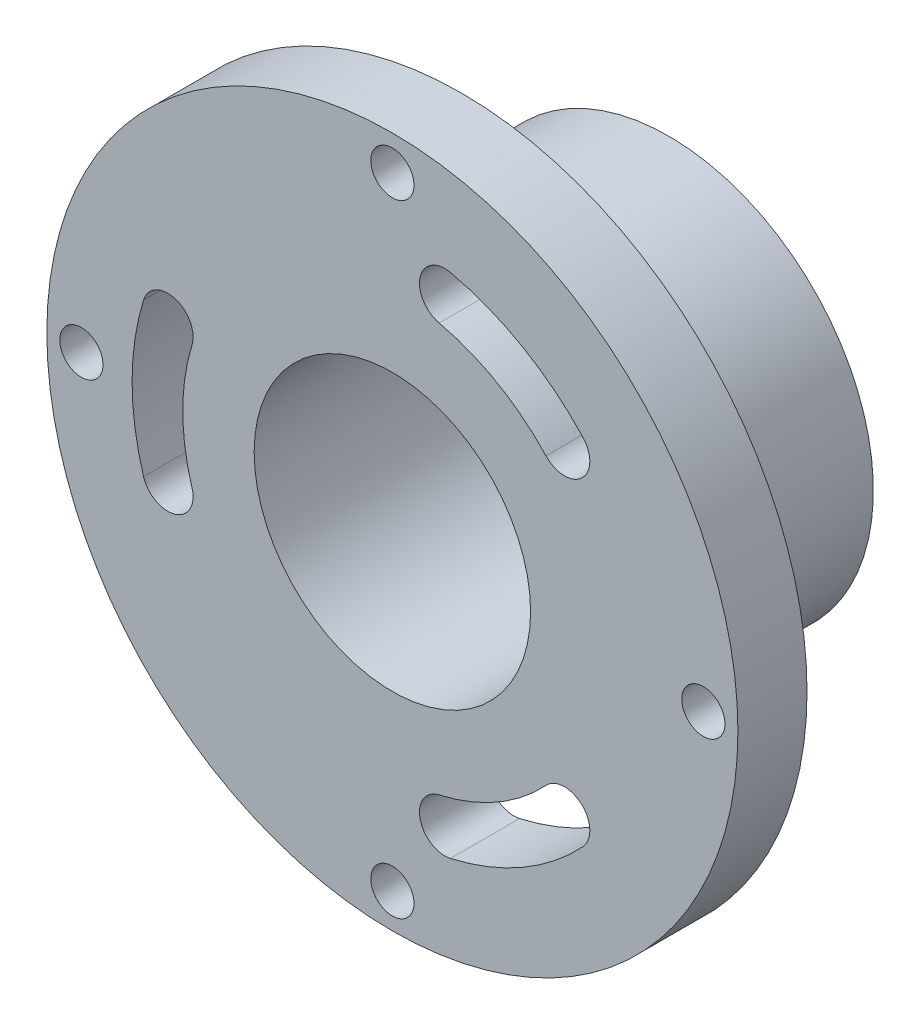
ISO-10303-21;
HEADER;
FILE_DESCRIPTION(('STEP AP214'),'2;1');
FILE_NAME('part.step','',(''),(''),'','','');
FILE_SCHEMA(('AUTOMOTIVE_DESIGN { 1 0 10303 214 1 1 1 1 }'));
ENDSEC;
DATA;
#1=APPLICATION_CONTEXT('core data for automotive mechanical design processes');
#2=APPLICATION_PROTOCOL_DEFINITION('international standard','automotive_design',2000,#1);
#3=PRODUCT_CONTEXT('',#1,'mechanical');
#4=PRODUCT('Part','Part','',(#3));
#5=PRODUCT_RELATED_PRODUCT_CATEGORY('part','',(#4));
#6=PRODUCT_DEFINITION_FORMATION('','',#4);
#7=PRODUCT_DEFINITION_CONTEXT('part definition',#1,'design');
#8=PRODUCT_DEFINITION('design','',#6,#7);
#9=PRODUCT_DEFINITION_SHAPE('','',#8);
#10=(LENGTH_UNIT() NAMED_UNIT(*) SI_UNIT(.MILLI.,.METRE.));
#11=(NAMED_UNIT(*) PLANE_ANGLE_UNIT() SI_UNIT($,.RADIAN.));
#12=(NAMED_UNIT(*) SI_UNIT($,.STERADIAN.) SOLID_ANGLE_UNIT());
#13=UNCERTAINTY_MEASURE_WITH_UNIT(LENGTH_MEASURE(1.E-05),#10,'distance_accuracy_value','');
#14=(GEOMETRIC_REPRESENTATION_CONTEXT(3) GLOBAL_UNCERTAINTY_ASSIGNED_CONTEXT((#13)) GLOBAL_UNIT_ASSIGNED_CONTEXT((#10,
#11,#12)) REPRESENTATION_CONTEXT('',''));
#15=CARTESIAN_POINT('',(0.,0.,0.));
#16=DIRECTION('',(0.,0.,1.));
#17=DIRECTION('',(1.,0.,0.));
#18=AXIS2_PLACEMENT_3D('',#15,#16,#17);
#19=CARTESIAN_POINT('',(0.,0.,25.4));
#20=DIRECTION('',(0.,0.,-1.));
#21=DIRECTION('',(-1.,0.,0.));
#22=AXIS2_PLACEMENT_3D('',#19,#20,#21);
#23=CYLINDRICAL_SURFACE('',#22,31.75);
#24=CARTESIAN_POINT('',(0.,0.,19.05));
#25=DIRECTION('',(0.,0.,1.));
#26=DIRECTION('',(1.,0.,0.));
#27=AXIS2_PLACEMENT_3D('',#24,#25,#26);
#28=CIRCLE('',#27,31.75);
#29=CARTESIAN_POINT('',(31.75,0.,19.05));
#30=VERTEX_POINT('',#29);
#31=EDGE_CURVE('E249',#30,#30,#28,.T.);
#32=ORIENTED_EDGE('',*,*,#31,.T.);
#33=EDGE_LOOP('',(#32));
#34=FACE_BOUND('',#33,.T.);
#35=CARTESIAN_POINT('',(0.,0.,25.4));
#36=DIRECTION('',(0.,0.,1.));
#37=DIRECTION('',(1.,0.,0.));
#38=AXIS2_PLACEMENT_3D('',#35,#36,#37);
#39=CIRCLE('',#38,31.75);
#40=CARTESIAN_POINT('',(31.75,0.,25.4));
#41=VERTEX_POINT('',#40);
#42=EDGE_CURVE('E250',#41,#41,#39,.T.);
#43=ORIENTED_EDGE('',*,*,#42,.F.);
#44=EDGE_LOOP('',(#43));
#45=FACE_BOUND('',#44,.T.);
#46=ADVANCED_FACE('F39',(#34,#45),#23,.T.);
#47=CARTESIAN_POINT('',(0.,0.,25.4));
#48=DIRECTION('',(0.,0.,1.));
#49=DIRECTION('',(1.,0.,0.));
#50=AXIS2_PLACEMENT_3D('',#47,#48,#49);
#51=PLANE('',#50);
#52=CARTESIAN_POINT('',(-20.6350575477753,6.35000000000007,25.4));
#53=DIRECTION('',(0.,0.,1.));
#54=DIRECTION('',(-0.499999999999992,0.866025403784443,0.));
#55=AXIS2_PLACEMENT_3D('',#52,#53,#54);
#56=CIRCLE('',#55,2.32586615757314);
#57=CARTESIAN_POINT('',(-18.4120662550498,5.6659217183609,25.4));
#58=VERTEX_POINT('',#57);
#59=CARTESIAN_POINT('',(-22.8580488405009,7.03407828163924,25.4));
#60=VERTEX_POINT('',#59);
#61=EDGE_CURVE('E53',#58,#60,#56,.T.);
#62=ORIENTED_EDGE('',*,*,#61,.F.);
#63=CARTESIAN_POINT('',(0.,0.,25.4));
#64=DIRECTION('',(0.,0.,-1.));
#65=DIRECTION('',(-0.499999999999992,0.866025403784443,0.));
#66=AXIS2_PLACEMENT_3D('',#63,#64,#65);
#67=CIRCLE('',#66,19.2641338424269);
#68=CARTESIAN_POINT('',(-18.4120662550498,-5.66592171836079,25.4));
#69=VERTEX_POINT('',#68);
#70=EDGE_CURVE('E152',#69,#58,#67,.T.);
#71=ORIENTED_EDGE('',*,*,#70,.F.);
#72=CARTESIAN_POINT('',(-20.6350575477754,-6.34999999999994,25.4));
#73=DIRECTION('',(0.,0.,1.));
#74=DIRECTION('',(-0.499999999999992,0.866025403784443,0.));
#75=AXIS2_PLACEMENT_3D('',#72,#73,#74);
#76=CIRCLE('',#75,2.32586615757314);
#77=CARTESIAN_POINT('',(-22.8580488405009,-7.03407828163909,25.4));
#78=VERTEX_POINT('',#77);
#79=EDGE_CURVE('E136',#78,#69,#76,.T.);
#80=ORIENTED_EDGE('',*,*,#79,.F.);
#81=CARTESIAN_POINT('',(0.,0.,25.4));
#82=DIRECTION('',(0.,0.,1.));
#83=DIRECTION('',(-0.499999999999992,0.866025403784443,0.));
#84=AXIS2_PLACEMENT_3D('',#81,#82,#83);
#85=CIRCLE('',#84,23.9158661575731);
#86=EDGE_CURVE('E145',#60,#78,#85,.T.);
#87=ORIENTED_EDGE('',*,*,#86,.F.);
#88=EDGE_LOOP('',(#62,#71,#80,#87));
#89=FACE_BOUND('',#88,.T.);
#90=CARTESIAN_POINT('',(4.81826745985651,-21.0454840449273,25.4));
#91=DIRECTION('',(0.,0.,1.));
#92=DIRECTION('',(-0.500000000000004,-0.866025403784436,0.));
#93=AXIS2_PLACEMENT_3D('',#90,#91,#92);
#94=CIRCLE('',#93,2.32586615757314);
#95=CARTESIAN_POINT('',(4.29920098357045,-18.7782779722157,25.4));
#96=VERTEX_POINT('',#95);
#97=CARTESIAN_POINT('',(5.33733393614257,-23.3126901176388,25.4));
#98=VERTEX_POINT('',#97);
#99=EDGE_CURVE('E159',#96,#98,#94,.T.);
#100=ORIENTED_EDGE('',*,*,#99,.F.);
#101=CARTESIAN_POINT('',(0.,0.,25.4));
#102=DIRECTION('',(0.,0.,-1.));
#103=DIRECTION('',(-0.500000000000004,-0.866025403784436,0.));
#104=AXIS2_PLACEMENT_3D('',#101,#102,#103);
#105=CIRCLE('',#104,19.2641338424269);
#106=CARTESIAN_POINT('',(14.1128652714794,-13.1123562538549,25.4));
#107=VERTEX_POINT('',#106);
#108=EDGE_CURVE('E169',#107,#96,#105,.T.);
#109=ORIENTED_EDGE('',*,*,#108,.F.);
#110=CARTESIAN_POINT('',(15.8167900879189,-14.6954840449272,25.4));
#111=DIRECTION('',(0.,0.,1.));
#112=DIRECTION('',(-0.500000000000004,-0.866025403784436,0.));
#113=AXIS2_PLACEMENT_3D('',#110,#111,#112);
#114=CIRCLE('',#113,2.32586615757314);
#115=CARTESIAN_POINT('',(17.5207149043584,-16.2786118359996,25.4));
#116=VERTEX_POINT('',#115);
#117=EDGE_CURVE('E166',#116,#107,#114,.T.);
#118=ORIENTED_EDGE('',*,*,#117,.F.);
#119=CARTESIAN_POINT('',(0.,0.,25.4));
#120=DIRECTION('',(0.,0.,1.));
#121=DIRECTION('',(-0.500000000000004,-0.866025403784436,0.));
#122=AXIS2_PLACEMENT_3D('',#119,#120,#121);
#123=CIRCLE('',#122,23.9158661575731);
#124=EDGE_CURVE('E163',#98,#116,#123,.T.);
#125=ORIENTED_EDGE('',*,*,#124,.F.);
#126=EDGE_LOOP('',(#100,#109,#118,#125));
#127=FACE_BOUND('',#126,.T.);
#128=CARTESIAN_POINT('',(15.8167900879188,14.6954840449274,25.4));
#129=DIRECTION('',(0.,0.,1.));
#130=DIRECTION('',(1.,0.,0.));
#131=AXIS2_PLACEMENT_3D('',#128,#129,#130);
#132=CIRCLE('',#131,2.32586615757314);
#133=CARTESIAN_POINT('',(14.1128652714793,13.112356253855,25.4));
#134=VERTEX_POINT('',#133);
#135=CARTESIAN_POINT('',(17.5207149043583,16.2786118359997,25.4));
#136=VERTEX_POINT('',#135);
#137=EDGE_CURVE('E175',#134,#136,#132,.T.);
#138=ORIENTED_EDGE('',*,*,#137,.F.);
#139=CARTESIAN_POINT('',(0.,0.,25.4));
#140=DIRECTION('',(0.,0.,-1.));
#141=DIRECTION('',(1.,0.,0.));
#142=AXIS2_PLACEMENT_3D('',#139,#140,#141);
#143=CIRCLE('',#142,19.2641338424269);
#144=CARTESIAN_POINT('',(4.2992009835703,18.7782779722158,25.4));
#145=VERTEX_POINT('',#144);
#146=EDGE_CURVE('E189',#145,#134,#143,.T.);
#147=ORIENTED_EDGE('',*,*,#146,.F.);
#148=CARTESIAN_POINT('',(4.81826745985635,21.0454840449273,25.4));
#149=DIRECTION('',(0.,0.,1.));
#150=DIRECTION('',(1.,0.,0.));
#151=AXIS2_PLACEMENT_3D('',#148,#149,#150);
#152=CIRCLE('',#151,2.32586615757314);
#153=CARTESIAN_POINT('',(5.3373339361424,23.3126901176388,25.4));
#154=VERTEX_POINT('',#153);
#155=EDGE_CURVE('E186',#154,#145,#152,.T.);
#156=ORIENTED_EDGE('',*,*,#155,.F.);
#157=CARTESIAN_POINT('',(0.,0.,25.4));
#158=DIRECTION('',(0.,0.,1.));
#159=DIRECTION('',(1.,0.,0.));
#160=AXIS2_PLACEMENT_3D('',#157,#158,#159);
#161=CIRCLE('',#160,23.9158661575731);
#162=EDGE_CURVE('E183',#136,#154,#161,.T.);
#163=ORIENTED_EDGE('',*,*,#162,.F.);
#164=EDGE_LOOP('',(#138,#147,#156,#163));
#165=FACE_BOUND('',#164,.T.);
#166=CARTESIAN_POINT('',(-28.575,0.,25.4));
#167=DIRECTION('',(0.,0.,1.));
#168=DIRECTION('',(1.,0.,0.));
#169=AXIS2_PLACEMENT_3D('',#166,#167,#168);
#170=CIRCLE('',#169,1.98437499999999);
#171=CARTESIAN_POINT('',(-26.590625,0.,25.4));
#172=VERTEX_POINT('',#171);
#173=EDGE_CURVE('E195',#172,#172,#170,.T.);
#174=ORIENTED_EDGE('',*,*,#173,.F.);
#175=EDGE_LOOP('',(#174));
#176=FACE_BOUND('',#175,.T.);
#177=CARTESIAN_POINT('',(0.,-28.575,25.4));
#178=DIRECTION('',(0.,0.,1.));
#179=DIRECTION('',(1.,0.,0.));
#180=AXIS2_PLACEMENT_3D('',#177,#178,#179);
#181=CIRCLE('',#180,1.98437499999999);
#182=CARTESIAN_POINT('',(1.98437499999999,-28.575,25.4));
#183=VERTEX_POINT('',#182);
#184=EDGE_CURVE('E207',#183,#183,#181,.T.);
#185=ORIENTED_EDGE('',*,*,#184,.F.);
#186=EDGE_LOOP('',(#185));
#187=FACE_BOUND('',#186,.T.);
#188=CARTESIAN_POINT('',(0.,28.575,25.4));
#189=DIRECTION('',(0.,0.,1.));
#190=DIRECTION('',(1.,0.,0.));
#191=AXIS2_PLACEMENT_3D('',#188,#189,#190);
#192=CIRCLE('',#191,1.98437499999999);
#193=CARTESIAN_POINT('',(1.98437499999999,28.575,25.4));
#194=VERTEX_POINT('',#193);
#195=EDGE_CURVE('E213',#194,#194,#192,.T.);
#196=ORIENTED_EDGE('',*,*,#195,.F.);
#197=EDGE_LOOP('',(#196));
#198=FACE_BOUND('',#197,.T.);
#199=CARTESIAN_POINT('',(28.575,0.,25.4));
#200=DIRECTION('',(0.,0.,1.));
#201=DIRECTION('',(1.,0.,0.));
#202=AXIS2_PLACEMENT_3D('',#199,#200,#201);
#203=CIRCLE('',#202,1.98437499999999);
#204=CARTESIAN_POINT('',(30.559375,0.,25.4));
#205=VERTEX_POINT('',#204);
#206=EDGE_CURVE('E219',#205,#205,#203,.T.);
#207=ORIENTED_EDGE('',*,*,#206,.F.);
#208=EDGE_LOOP('',(#207));
#209=FACE_BOUND('',#208,.T.);
#210=CARTESIAN_POINT('',(0.,0.,25.4));
#211=DIRECTION('',(0.,0.,-1.));
#212=DIRECTION('',(-1.,0.,0.));
#213=AXIS2_PLACEMENT_3D('',#210,#211,#212);
#214=CIRCLE('',#213,12.7);
#215=CARTESIAN_POINT('',(-12.7,0.,25.4));
#216=VERTEX_POINT('',#215);
#217=EDGE_CURVE('E238',#216,#216,#214,.T.);
#218=ORIENTED_EDGE('',*,*,#217,.T.);
#219=EDGE_LOOP('',(#218));
#220=FACE_BOUND('',#219,.T.);
#221=ORIENTED_EDGE('',*,*,#42,.T.);
#222=EDGE_LOOP('',(#221));
#223=FACE_BOUND('',#222,.T.);
#224=ADVANCED_FACE('F149',(#89,#127,#165,#176,#187,#198,#209,#220,#223),#51,.T.);
#225=CARTESIAN_POINT('',(0.,0.,19.05));
#226=DIRECTION('',(0.,0.,1.));
#227=DIRECTION('',(1.,0.,0.));
#228=AXIS2_PLACEMENT_3D('',#225,#226,#227);
#229=PLANE('',#228);
#230=CARTESIAN_POINT('',(0.,0.,19.05));
#231=DIRECTION('',(0.,0.,1.));
#232=DIRECTION('',(1.,0.,0.));
#233=AXIS2_PLACEMENT_3D('',#230,#231,#232);
#234=CIRCLE('',#233,19.2641338424269);
#235=CARTESIAN_POINT('',(-18.4120662550498,-5.66592171836079,19.05));
#236=VERTEX_POINT('',#235);
#237=CARTESIAN_POINT('',(-18.4120662550498,5.6659217183609,19.05));
#238=VERTEX_POINT('',#237);
#239=EDGE_CURVE('E46',#236,#238,#234,.F.);
#240=ORIENTED_EDGE('',*,*,#239,.T.);
#241=CARTESIAN_POINT('',(-20.6350575477753,6.35000000000007,19.05));
#242=DIRECTION('',(0.,0.,1.));
#243=DIRECTION('',(1.,0.,0.));
#244=AXIS2_PLACEMENT_3D('',#241,#242,#243);
#245=CIRCLE('',#244,2.32586615757314);
#246=CARTESIAN_POINT('',(-22.8580488405009,7.03407828163924,19.05));
#247=VERTEX_POINT('',#246);
#248=EDGE_CURVE('E12',#238,#247,#245,.T.);
#249=ORIENTED_EDGE('',*,*,#248,.T.);
#250=CARTESIAN_POINT('',(0.,0.,19.05));
#251=DIRECTION('',(0.,0.,1.));
#252=DIRECTION('',(1.,0.,0.));
#253=AXIS2_PLACEMENT_3D('',#250,#251,#252);
#254=CIRCLE('',#253,23.9158661575731);
#255=CARTESIAN_POINT('',(-22.8580488405009,-7.03407828163909,19.05));
#256=VERTEX_POINT('',#255);
#257=EDGE_CURVE('E279',#247,#256,#254,.T.);
#258=ORIENTED_EDGE('',*,*,#257,.T.);
#259=CARTESIAN_POINT('',(-20.6350575477754,-6.34999999999994,19.05));
#260=DIRECTION('',(0.,0.,1.));
#261=DIRECTION('',(1.,0.,0.));
#262=AXIS2_PLACEMENT_3D('',#259,#260,#261);
#263=CIRCLE('',#262,2.32586615757314);
#264=EDGE_CURVE('E139',#256,#236,#263,.T.);
#265=ORIENTED_EDGE('',*,*,#264,.T.);
#266=EDGE_LOOP('',(#240,#249,#258,#265));
#267=FACE_BOUND('',#266,.T.);
#268=CARTESIAN_POINT('',(0.,0.,19.05));
#269=DIRECTION('',(0.,0.,1.));
#270=DIRECTION('',(1.,0.,0.));
#271=AXIS2_PLACEMENT_3D('',#268,#269,#270);
#272=CIRCLE('',#271,19.2641338424269);
#273=CARTESIAN_POINT('',(14.1128652714794,-13.1123562538549,19.05));
#274=VERTEX_POINT('',#273);
#275=CARTESIAN_POINT('',(4.29920098357045,-18.7782779722157,19.05));
#276=VERTEX_POINT('',#275);
#277=EDGE_CURVE('E273',#274,#276,#272,.F.);
#278=ORIENTED_EDGE('',*,*,#277,.T.);
#279=CARTESIAN_POINT('',(4.81826745985651,-21.0454840449273,19.05));
#280=DIRECTION('',(0.,0.,1.));
#281=DIRECTION('',(1.,0.,0.));
#282=AXIS2_PLACEMENT_3D('',#279,#280,#281);
#283=CIRCLE('',#282,2.32586615757314);
#284=CARTESIAN_POINT('',(5.33733393614257,-23.3126901176388,19.05));
#285=VERTEX_POINT('',#284);
#286=EDGE_CURVE('E276',#276,#285,#283,.T.);
#287=ORIENTED_EDGE('',*,*,#286,.T.);
#288=CARTESIAN_POINT('',(0.,0.,19.05));
#289=DIRECTION('',(0.,0.,1.));
#290=DIRECTION('',(1.,0.,0.));
#291=AXIS2_PLACEMENT_3D('',#288,#289,#290);
#292=CIRCLE('',#291,23.9158661575731);
#293=CARTESIAN_POINT('',(17.5207149043584,-16.2786118359996,19.05));
#294=VERTEX_POINT('',#293);
#295=EDGE_CURVE('E267',#285,#294,#292,.T.);
#296=ORIENTED_EDGE('',*,*,#295,.T.);
#297=CARTESIAN_POINT('',(15.8167900879189,-14.6954840449272,19.05));
#298=DIRECTION('',(0.,0.,1.));
#299=DIRECTION('',(1.,0.,0.));
#300=AXIS2_PLACEMENT_3D('',#297,#298,#299);
#301=CIRCLE('',#300,2.32586615757314);
#302=EDGE_CURVE('E270',#294,#274,#301,.T.);
#303=ORIENTED_EDGE('',*,*,#302,.T.);
#304=EDGE_LOOP('',(#278,#287,#296,#303));
#305=FACE_BOUND('',#304,.T.);
#306=CARTESIAN_POINT('',(0.,0.,19.05));
#307=DIRECTION('',(0.,0.,1.));
#308=DIRECTION('',(1.,0.,0.));
#309=AXIS2_PLACEMENT_3D('',#306,#307,#308);
#310=CIRCLE('',#309,19.2641338424269);
#311=CARTESIAN_POINT('',(4.2992009835703,18.7782779722158,19.05));
#312=VERTEX_POINT('',#311);
#313=CARTESIAN_POINT('',(14.1128652714793,13.112356253855,19.05));
#314=VERTEX_POINT('',#313);
#315=EDGE_CURVE('E261',#312,#314,#310,.F.);
#316=ORIENTED_EDGE('',*,*,#315,.T.);
#317=CARTESIAN_POINT('',(15.8167900879188,14.6954840449274,19.05));
#318=DIRECTION('',(0.,0.,1.));
#319=DIRECTION('',(1.,0.,0.));
#320=AXIS2_PLACEMENT_3D('',#317,#318,#319);
#321=CIRCLE('',#320,2.32586615757314);
#322=CARTESIAN_POINT('',(17.5207149043583,16.2786118359997,19.05));
#323=VERTEX_POINT('',#322);
#324=EDGE_CURVE('E264',#314,#323,#321,.T.);
#325=ORIENTED_EDGE('',*,*,#324,.T.);
#326=CARTESIAN_POINT('',(0.,0.,19.05));
#327=DIRECTION('',(0.,0.,1.));
#328=DIRECTION('',(1.,0.,0.));
#329=AXIS2_PLACEMENT_3D('',#326,#327,#328);
#330=CIRCLE('',#329,23.9158661575731);
#331=CARTESIAN_POINT('',(5.3373339361424,23.3126901176388,19.05));
#332=VERTEX_POINT('',#331);
#333=EDGE_CURVE('E253',#323,#332,#330,.T.);
#334=ORIENTED_EDGE('',*,*,#333,.T.);
#335=CARTESIAN_POINT('',(4.81826745985635,21.0454840449273,19.05));
#336=DIRECTION('',(0.,0.,1.));
#337=DIRECTION('',(1.,0.,0.));
#338=AXIS2_PLACEMENT_3D('',#335,#336,#337);
#339=CIRCLE('',#338,2.32586615757314);
#340=EDGE_CURVE('E258',#332,#312,#339,.T.);
#341=ORIENTED_EDGE('',*,*,#340,.T.);
#342=EDGE_LOOP('',(#316,#325,#334,#341));
#343=FACE_BOUND('',#342,.T.);
#344=CARTESIAN_POINT('',(-28.575,0.,19.05));
#345=DIRECTION('',(0.,0.,1.));
#346=DIRECTION('',(1.,0.,0.));
#347=AXIS2_PLACEMENT_3D('',#344,#345,#346);
#348=CIRCLE('',#347,1.98437499999999);
#349=CARTESIAN_POINT('',(-26.590625,0.,19.05));
#350=VERTEX_POINT('',#349);
#351=EDGE_CURVE('E204',#350,#350,#348,.T.);
#352=ORIENTED_EDGE('',*,*,#351,.T.);
#353=EDGE_LOOP('',(#352));
#354=FACE_BOUND('',#353,.T.);
#355=CARTESIAN_POINT('',(0.,-28.575,19.05));
#356=DIRECTION('',(0.,0.,1.));
#357=DIRECTION('',(1.,0.,0.));
#358=AXIS2_PLACEMENT_3D('',#355,#356,#357);
#359=CIRCLE('',#358,1.98437499999999);
#360=CARTESIAN_POINT('',(1.98437499999999,-28.575,19.05));
#361=VERTEX_POINT('',#360);
#362=EDGE_CURVE('E210',#361,#361,#359,.T.);
#363=ORIENTED_EDGE('',*,*,#362,.T.);
#364=EDGE_LOOP('',(#363));
#365=FACE_BOUND('',#364,.T.);
#366=CARTESIAN_POINT('',(0.,28.575,19.05));
#367=DIRECTION('',(0.,0.,1.));
#368=DIRECTION('',(1.,0.,0.));
#369=AXIS2_PLACEMENT_3D('',#366,#367,#368);
#370=CIRCLE('',#369,1.98437499999999);
#371=CARTESIAN_POINT('',(1.98437499999999,28.575,19.05));
#372=VERTEX_POINT('',#371);
#373=EDGE_CURVE('E216',#372,#372,#370,.T.);
#374=ORIENTED_EDGE('',*,*,#373,.T.);
#375=EDGE_LOOP('',(#374));
#376=FACE_BOUND('',#375,.T.);
#377=CARTESIAN_POINT('',(28.575,0.,19.05));
#378=DIRECTION('',(0.,0.,1.));
#379=DIRECTION('',(1.,0.,0.));
#380=AXIS2_PLACEMENT_3D('',#377,#378,#379);
#381=CIRCLE('',#380,1.98437499999999);
#382=CARTESIAN_POINT('',(30.559375,0.,19.05));
#383=VERTEX_POINT('',#382);
#384=EDGE_CURVE('E222',#383,#383,#381,.T.);
#385=ORIENTED_EDGE('',*,*,#384,.T.);
#386=EDGE_LOOP('',(#385));
#387=FACE_BOUND('',#386,.T.);
#388=CARTESIAN_POINT('',(0.,0.,19.05));
#389=DIRECTION('',(0.,0.,1.));
#390=DIRECTION('',(1.,0.,0.));
#391=AXIS2_PLACEMENT_3D('',#388,#389,#390);
#392=CIRCLE('',#391,18.796);
#393=CARTESIAN_POINT('',(18.796,0.,19.05));
#394=VERTEX_POINT('',#393);
#395=EDGE_CURVE('E246',#394,#394,#392,.F.);
#396=ORIENTED_EDGE('',*,*,#395,.F.);
#397=EDGE_LOOP('',(#396));
#398=FACE_BOUND('',#397,.T.);
#399=ORIENTED_EDGE('',*,*,#31,.F.);
#400=EDGE_LOOP('',(#399));
#401=FACE_BOUND('',#400,.T.);
#402=ADVANCED_FACE('F283',(#267,#305,#343,#354,#365,#376,#387,#398,#401),#229,.F.);
#403=CARTESIAN_POINT('',(0.,0.,128.800586822798));
#404=DIRECTION('',(0.,0.,-1.));
#405=DIRECTION('',(-1.,0.,0.));
#406=AXIS2_PLACEMENT_3D('',#403,#404,#405);
#407=CYLINDRICAL_SURFACE('',#406,18.796);
#408=CARTESIAN_POINT('',(0.,0.,0.));
#409=DIRECTION('',(0.,0.,-1.));
#410=DIRECTION('',(-1.,0.,0.));
#411=AXIS2_PLACEMENT_3D('',#408,#409,#410);
#412=CIRCLE('',#411,18.796);
#413=CARTESIAN_POINT('',(-18.796,0.,0.));
#414=VERTEX_POINT('',#413);
#415=EDGE_CURVE('E241',#414,#414,#412,.T.);
#416=ORIENTED_EDGE('',*,*,#415,.F.);
#417=EDGE_LOOP('',(#416));
#418=FACE_BOUND('',#417,.T.);
#419=ORIENTED_EDGE('',*,*,#395,.T.);
#420=EDGE_LOOP('',(#419));
#421=FACE_BOUND('',#420,.T.);
#422=ADVANCED_FACE('F314',(#418,#421),#407,.T.);
#423=CARTESIAN_POINT('',(0.,0.,0.));
#424=DIRECTION('',(0.,0.,1.));
#425=DIRECTION('',(1.,0.,0.));
#426=AXIS2_PLACEMENT_3D('',#423,#424,#425);
#427=PLANE('',#426);
#428=CARTESIAN_POINT('',(0.,15.24,0.));
#429=DIRECTION('',(0.,0.,-1.));
#430=DIRECTION('',(-1.,0.,0.));
#431=AXIS2_PLACEMENT_3D('',#428,#429,#430);
#432=CIRCLE('',#431,0.888999999999999);
#433=CARTESIAN_POINT('',(-0.888999999999999,15.24,0.));
#434=VERTEX_POINT('',#433);
#435=EDGE_CURVE('E225',#434,#434,#432,.T.);
#436=ORIENTED_EDGE('',*,*,#435,.F.);
#437=EDGE_LOOP('',(#436));
#438=FACE_BOUND('',#437,.T.);
#439=CARTESIAN_POINT('',(0.,-15.24,0.));
#440=DIRECTION('',(0.,0.,-1.));
#441=DIRECTION('',(-1.,0.,0.));
#442=AXIS2_PLACEMENT_3D('',#439,#440,#441);
#443=CIRCLE('',#442,0.888999999999999);
#444=CARTESIAN_POINT('',(-0.888999999999999,-15.24,0.));
#445=VERTEX_POINT('',#444);
#446=EDGE_CURVE('E231',#445,#445,#443,.T.);
#447=ORIENTED_EDGE('',*,*,#446,.F.);
#448=EDGE_LOOP('',(#447));
#449=FACE_BOUND('',#448,.T.);
#450=CARTESIAN_POINT('',(0.,0.,0.));
#451=DIRECTION('',(0.,0.,-1.));
#452=DIRECTION('',(-1.,0.,0.));
#453=AXIS2_PLACEMENT_3D('',#450,#451,#452);
#454=CIRCLE('',#453,12.7);
#455=CARTESIAN_POINT('',(-12.7,0.,0.));
#456=VERTEX_POINT('',#455);
#457=EDGE_CURVE('E237',#456,#456,#454,.T.);
#458=ORIENTED_EDGE('',*,*,#457,.F.);
#459=EDGE_LOOP('',(#458));
#460=FACE_BOUND('',#459,.T.);
#461=ORIENTED_EDGE('',*,*,#415,.T.);
#462=EDGE_LOOP('',(#461));
#463=FACE_BOUND('',#462,.T.);
#464=ADVANCED_FACE('F319',(#438,#449,#460,#463),#427,.F.);
#465=CARTESIAN_POINT('',(0.,0.,25.4));
#466=DIRECTION('',(0.,0.,-1.));
#467=DIRECTION('',(-1.,0.,0.));
#468=AXIS2_PLACEMENT_3D('',#465,#466,#467);
#469=CYLINDRICAL_SURFACE('',#468,12.7);
#470=ORIENTED_EDGE('',*,*,#217,.F.);
#471=EDGE_LOOP('',(#470));
#472=FACE_BOUND('',#471,.T.);
#473=ORIENTED_EDGE('',*,*,#457,.T.);
#474=EDGE_LOOP('',(#473));
#475=FACE_BOUND('',#474,.T.);
#476=ADVANCED_FACE('F324',(#472,#475),#469,.F.);
#477=CARTESIAN_POINT('',(0.,-15.24,5.73278));
#478=DIRECTION('',(0.,0.,-1.));
#479=DIRECTION('',(-1.,0.,0.));
#480=AXIS2_PLACEMENT_3D('',#477,#478,#479);
#481=CONICAL_SURFACE('',#480,0.888999999999998,1.02974425867665);
#482=CARTESIAN_POINT('',(0.,-15.24,6.2669450903155));
#483=VERTEX_POINT('',#482);
#484=VERTEX_LOOP('',#483);
#485=FACE_BOUND('',#484,.T.);
#486=CARTESIAN_POINT('',(0.,-15.24,5.73278));
#487=DIRECTION('',(0.,0.,-1.));
#488=DIRECTION('',(-1.,0.,0.));
#489=AXIS2_PLACEMENT_3D('',#486,#487,#488);
#490=CIRCLE('',#489,0.888999999999998);
#491=CARTESIAN_POINT('',(-0.888999999999998,-15.24,5.73278));
#492=VERTEX_POINT('',#491);
#493=EDGE_CURVE('E234',#492,#492,#490,.T.);
#494=ORIENTED_EDGE('',*,*,#493,.T.);
#495=EDGE_LOOP('',(#494));
#496=FACE_BOUND('',#495,.T.);
#497=ADVANCED_FACE('F329',(#485,#496),#481,.F.);
#498=CARTESIAN_POINT('',(0.,-15.24,0.));
#499=DIRECTION('',(0.,0.,-1.));
#500=DIRECTION('',(-1.,0.,0.));
#501=AXIS2_PLACEMENT_3D('',#498,#499,#500);
#502=CYLINDRICAL_SURFACE('',#501,0.888999999999999);
#503=ORIENTED_EDGE('',*,*,#493,.F.);
#504=EDGE_LOOP('',(#503));
#505=FACE_BOUND('',#504,.T.);
#506=ORIENTED_EDGE('',*,*,#446,.T.);
#507=EDGE_LOOP('',(#506));
#508=FACE_BOUND('',#507,.T.);
#509=ADVANCED_FACE('F343',(#505,#508),#502,.F.);
#510=CARTESIAN_POINT('',(0.,15.24,5.73278));
#511=DIRECTION('',(0.,0.,-1.));
#512=DIRECTION('',(-1.,0.,0.));
#513=AXIS2_PLACEMENT_3D('',#510,#511,#512);
#514=CONICAL_SURFACE('',#513,0.888999999999998,1.02974425867665);
#515=CARTESIAN_POINT('',(0.,15.24,6.2669450903155));
#516=VERTEX_POINT('',#515);
#517=VERTEX_LOOP('',#516);
#518=FACE_BOUND('',#517,.T.);
#519=CARTESIAN_POINT('',(0.,15.24,5.73278));
#520=DIRECTION('',(0.,0.,-1.));
#521=DIRECTION('',(-1.,0.,0.));
#522=AXIS2_PLACEMENT_3D('',#519,#520,#521);
#523=CIRCLE('',#522,0.888999999999998);
#524=CARTESIAN_POINT('',(-0.888999999999998,15.24,5.73278));
#525=VERTEX_POINT('',#524);
#526=EDGE_CURVE('E228',#525,#525,#523,.T.);
#527=ORIENTED_EDGE('',*,*,#526,.T.);
#528=EDGE_LOOP('',(#527));
#529=FACE_BOUND('',#528,.T.);
#530=ADVANCED_FACE('F345',(#518,#529),#514,.F.);
#531=CARTESIAN_POINT('',(0.,15.24,0.));
#532=DIRECTION('',(0.,0.,-1.));
#533=DIRECTION('',(-1.,0.,0.));
#534=AXIS2_PLACEMENT_3D('',#531,#532,#533);
#535=CYLINDRICAL_SURFACE('',#534,0.888999999999999);
#536=ORIENTED_EDGE('',*,*,#526,.F.);
#537=EDGE_LOOP('',(#536));
#538=FACE_BOUND('',#537,.T.);
#539=ORIENTED_EDGE('',*,*,#435,.T.);
#540=EDGE_LOOP('',(#539));
#541=FACE_BOUND('',#540,.T.);
#542=ADVANCED_FACE('F352',(#538,#541),#535,.F.);
#543=CARTESIAN_POINT('',(28.575,0.,25.4));
#544=DIRECTION('',(0.,0.,1.));
#545=DIRECTION('',(1.,0.,0.));
#546=AXIS2_PLACEMENT_3D('',#543,#544,#545);
#547=CYLINDRICAL_SURFACE('',#546,1.98437499999999);
#548=ORIENTED_EDGE('',*,*,#206,.T.);
#549=EDGE_LOOP('',(#548));
#550=FACE_BOUND('',#549,.T.);
#551=ORIENTED_EDGE('',*,*,#384,.F.);
#552=EDGE_LOOP('',(#551));
#553=FACE_BOUND('',#552,.T.);
#554=ADVANCED_FACE('F361',(#550,#553),#547,.F.);
#555=CARTESIAN_POINT('',(0.,28.575,25.4));
#556=DIRECTION('',(0.,0.,1.));
#557=DIRECTION('',(1.,0.,0.));
#558=AXIS2_PLACEMENT_3D('',#555,#556,#557);
#559=CYLINDRICAL_SURFACE('',#558,1.98437499999999);
#560=ORIENTED_EDGE('',*,*,#195,.T.);
#561=EDGE_LOOP('',(#560));
#562=FACE_BOUND('',#561,.T.);
#563=ORIENTED_EDGE('',*,*,#373,.F.);
#564=EDGE_LOOP('',(#563));
#565=FACE_BOUND('',#564,.T.);
#566=ADVANCED_FACE('F365',(#562,#565),#559,.F.);
#567=CARTESIAN_POINT('',(0.,-28.575,25.4));
#568=DIRECTION('',(0.,0.,1.));
#569=DIRECTION('',(1.,0.,0.));
#570=AXIS2_PLACEMENT_3D('',#567,#568,#569);
#571=CYLINDRICAL_SURFACE('',#570,1.98437499999999);
#572=ORIENTED_EDGE('',*,*,#184,.T.);
#573=EDGE_LOOP('',(#572));
#574=FACE_BOUND('',#573,.T.);
#575=ORIENTED_EDGE('',*,*,#362,.F.);
#576=EDGE_LOOP('',(#575));
#577=FACE_BOUND('',#576,.T.);
#578=ADVANCED_FACE('F369',(#574,#577),#571,.F.);
#579=CARTESIAN_POINT('',(-28.575,0.,25.4));
#580=DIRECTION('',(0.,0.,1.));
#581=DIRECTION('',(1.,0.,0.));
#582=AXIS2_PLACEMENT_3D('',#579,#580,#581);
#583=CYLINDRICAL_SURFACE('',#582,1.98437499999999);
#584=ORIENTED_EDGE('',*,*,#173,.T.);
#585=EDGE_LOOP('',(#584));
#586=FACE_BOUND('',#585,.T.);
#587=ORIENTED_EDGE('',*,*,#351,.F.);
#588=EDGE_LOOP('',(#587));
#589=FACE_BOUND('',#588,.T.);
#590=ADVANCED_FACE('F373',(#586,#589),#583,.F.);
#591=CARTESIAN_POINT('',(15.8167900879188,14.6954840449274,0.));
#592=DIRECTION('',(0.,0.,1.));
#593=DIRECTION('',(1.,0.,0.));
#594=AXIS2_PLACEMENT_3D('',#591,#592,#593);
#595=CYLINDRICAL_SURFACE('',#594,2.32586615757314);
#596=DIRECTION('',(0.,0.,1.));
#597=VECTOR('',#596,1.);
#598=CARTESIAN_POINT('',(14.1128652714793,13.112356253855,0.));
#599=LINE('',#598,#597);
#600=EDGE_CURVE('E193',#314,#134,#599,.T.);
#601=ORIENTED_EDGE('',*,*,#600,.T.);
#602=ORIENTED_EDGE('',*,*,#137,.T.);
#603=DIRECTION('',(0.,0.,1.));
#604=VECTOR('',#603,1.);
#605=CARTESIAN_POINT('',(17.5207149043583,16.2786118359997,0.));
#606=LINE('',#605,#604);
#607=EDGE_CURVE('E192',#323,#136,#606,.T.);
#608=ORIENTED_EDGE('',*,*,#607,.F.);
#609=ORIENTED_EDGE('',*,*,#324,.F.);
#610=EDGE_LOOP('',(#601,#602,#608,#609));
#611=FACE_BOUND('',#610,.T.);
#612=ADVANCED_FACE('F377',(#611),#595,.F.);
#613=CARTESIAN_POINT('',(0.,0.,0.));
#614=DIRECTION('',(0.,0.,1.));
#615=DIRECTION('',(1.,0.,0.));
#616=AXIS2_PLACEMENT_3D('',#613,#614,#615);
#617=CYLINDRICAL_SURFACE('',#616,19.2641338424269);
#618=DIRECTION('',(0.,0.,1.));
#619=VECTOR('',#618,1.);
#620=CARTESIAN_POINT('',(4.2992009835703,18.7782779722158,0.));
#621=LINE('',#620,#619);
#622=EDGE_CURVE('E196',#312,#145,#621,.T.);
#623=ORIENTED_EDGE('',*,*,#622,.T.);
#624=ORIENTED_EDGE('',*,*,#146,.T.);
#625=ORIENTED_EDGE('',*,*,#600,.F.);
#626=ORIENTED_EDGE('',*,*,#315,.F.);
#627=EDGE_LOOP('',(#623,#624,#625,#626));
#628=FACE_BOUND('',#627,.T.);
#629=ADVANCED_FACE('F381',(#628),#617,.T.);
#630=CARTESIAN_POINT('',(4.81826745985635,21.0454840449273,0.));
#631=DIRECTION('',(0.,0.,1.));
#632=DIRECTION('',(1.,0.,0.));
#633=AXIS2_PLACEMENT_3D('',#630,#631,#632);
#634=CYLINDRICAL_SURFACE('',#633,2.32586615757314);
#635=DIRECTION('',(0.,0.,1.));
#636=VECTOR('',#635,1.);
#637=CARTESIAN_POINT('',(5.3373339361424,23.3126901176388,0.));
#638=LINE('',#637,#636);
#639=EDGE_CURVE('E198',#332,#154,#638,.T.);
#640=ORIENTED_EDGE('',*,*,#639,.T.);
#641=ORIENTED_EDGE('',*,*,#155,.T.);
#642=ORIENTED_EDGE('',*,*,#622,.F.);
#643=ORIENTED_EDGE('',*,*,#340,.F.);
#644=EDGE_LOOP('',(#640,#641,#642,#643));
#645=FACE_BOUND('',#644,.T.);
#646=ADVANCED_FACE('F387',(#645),#634,.F.);
#647=CARTESIAN_POINT('',(0.,0.,0.));
#648=DIRECTION('',(0.,0.,1.));
#649=DIRECTION('',(1.,0.,0.));
#650=AXIS2_PLACEMENT_3D('',#647,#648,#649);
#651=CYLINDRICAL_SURFACE('',#650,23.9158661575731);
#652=ORIENTED_EDGE('',*,*,#607,.T.);
#653=ORIENTED_EDGE('',*,*,#162,.T.);
#654=ORIENTED_EDGE('',*,*,#639,.F.);
#655=ORIENTED_EDGE('',*,*,#333,.F.);
#656=EDGE_LOOP('',(#652,#653,#654,#655));
#657=FACE_BOUND('',#656,.T.);
#658=ADVANCED_FACE('F383',(#657),#651,.F.);
#659=CARTESIAN_POINT('',(4.81826745985651,-21.0454840449273,0.));
#660=DIRECTION('',(0.,0.,1.));
#661=DIRECTION('',(1.,0.,0.));
#662=AXIS2_PLACEMENT_3D('',#659,#660,#661);
#663=CYLINDRICAL_SURFACE('',#662,2.32586615757314);
#664=DIRECTION('',(0.,0.,1.));
#665=VECTOR('',#664,1.);
#666=CARTESIAN_POINT('',(4.29920098357045,-18.7782779722157,0.));
#667=LINE('',#666,#665);
#668=EDGE_CURVE('E173',#276,#96,#667,.T.);
#669=ORIENTED_EDGE('',*,*,#668,.T.);
#670=ORIENTED_EDGE('',*,*,#99,.T.);
#671=DIRECTION('',(0.,0.,1.));
#672=VECTOR('',#671,1.);
#673=CARTESIAN_POINT('',(5.33733393614257,-23.3126901176388,0.));
#674=LINE('',#673,#672);
#675=EDGE_CURVE('E172',#285,#98,#674,.T.);
#676=ORIENTED_EDGE('',*,*,#675,.F.);
#677=ORIENTED_EDGE('',*,*,#286,.F.);
#678=EDGE_LOOP('',(#669,#670,#676,#677));
#679=FACE_BOUND('',#678,.T.);
#680=ADVANCED_FACE('F386',(#679),#663,.F.);
#681=CARTESIAN_POINT('',(0.,0.,0.));
#682=DIRECTION('',(0.,0.,1.));
#683=DIRECTION('',(1.,0.,0.));
#684=AXIS2_PLACEMENT_3D('',#681,#682,#683);
#685=CYLINDRICAL_SURFACE('',#684,19.2641338424269);
#686=DIRECTION('',(0.,0.,1.));
#687=VECTOR('',#686,1.);
#688=CARTESIAN_POINT('',(14.1128652714794,-13.1123562538549,0.));
#689=LINE('',#688,#687);
#690=EDGE_CURVE('E176',#274,#107,#689,.T.);
#691=ORIENTED_EDGE('',*,*,#690,.T.);
#692=ORIENTED_EDGE('',*,*,#108,.T.);
#693=ORIENTED_EDGE('',*,*,#668,.F.);
#694=ORIENTED_EDGE('',*,*,#277,.F.);
#695=EDGE_LOOP('',(#691,#692,#693,#694));
#696=FACE_BOUND('',#695,.T.);
#697=ADVANCED_FACE('F396',(#696),#685,.T.);
#698=CARTESIAN_POINT('',(15.8167900879189,-14.6954840449272,0.));
#699=DIRECTION('',(0.,0.,1.));
#700=DIRECTION('',(1.,0.,0.));
#701=AXIS2_PLACEMENT_3D('',#698,#699,#700);
#702=CYLINDRICAL_SURFACE('',#701,2.32586615757314);
#703=DIRECTION('',(0.,0.,1.));
#704=VECTOR('',#703,1.);
#705=CARTESIAN_POINT('',(17.5207149043584,-16.2786118359996,0.));
#706=LINE('',#705,#704);
#707=EDGE_CURVE('E178',#294,#116,#706,.T.);
#708=ORIENTED_EDGE('',*,*,#707,.T.);
#709=ORIENTED_EDGE('',*,*,#117,.T.);
#710=ORIENTED_EDGE('',*,*,#690,.F.);
#711=ORIENTED_EDGE('',*,*,#302,.F.);
#712=EDGE_LOOP('',(#708,#709,#710,#711));
#713=FACE_BOUND('',#712,.T.);
#714=ADVANCED_FACE('F297',(#713),#702,.F.);
#715=CARTESIAN_POINT('',(0.,0.,0.));
#716=DIRECTION('',(0.,0.,1.));
#717=DIRECTION('',(1.,0.,0.));
#718=AXIS2_PLACEMENT_3D('',#715,#716,#717);
#719=CYLINDRICAL_SURFACE('',#718,23.9158661575731);
#720=ORIENTED_EDGE('',*,*,#675,.T.);
#721=ORIENTED_EDGE('',*,*,#124,.T.);
#722=ORIENTED_EDGE('',*,*,#707,.F.);
#723=ORIENTED_EDGE('',*,*,#295,.F.);
#724=EDGE_LOOP('',(#720,#721,#722,#723));
#725=FACE_BOUND('',#724,.T.);
#726=ADVANCED_FACE('F290',(#725),#719,.F.);
#727=CARTESIAN_POINT('',(-20.6350575477753,6.35000000000007,0.));
#728=DIRECTION('',(0.,0.,1.));
#729=DIRECTION('',(1.,0.,0.));
#730=AXIS2_PLACEMENT_3D('',#727,#728,#729);
#731=CYLINDRICAL_SURFACE('',#730,2.32586615757314);
#732=DIRECTION('',(0.,0.,1.));
#733=VECTOR('',#732,1.);
#734=CARTESIAN_POINT('',(-18.4120662550498,5.6659217183609,0.));
#735=LINE('',#734,#733);
#736=EDGE_CURVE('E157',#238,#58,#735,.T.);
#737=ORIENTED_EDGE('',*,*,#736,.T.);
#738=ORIENTED_EDGE('',*,*,#61,.T.);
#739=DIRECTION('',(0.,0.,1.));
#740=VECTOR('',#739,1.);
#741=CARTESIAN_POINT('',(-22.8580488405009,7.03407828163924,0.));
#742=LINE('',#741,#740);
#743=EDGE_CURVE('E142',#247,#60,#742,.T.);
#744=ORIENTED_EDGE('',*,*,#743,.F.);
#745=ORIENTED_EDGE('',*,*,#248,.F.);
#746=EDGE_LOOP('',(#737,#738,#744,#745));
#747=FACE_BOUND('',#746,.T.);
#748=ADVANCED_FACE('F288',(#747),#731,.F.);
#749=CARTESIAN_POINT('',(0.,0.,0.));
#750=DIRECTION('',(0.,0.,1.));
#751=DIRECTION('',(1.,0.,0.));
#752=AXIS2_PLACEMENT_3D('',#749,#750,#751);
#753=CYLINDRICAL_SURFACE('',#752,19.2641338424269);
#754=DIRECTION('',(0.,0.,1.));
#755=VECTOR('',#754,1.);
#756=CARTESIAN_POINT('',(-18.4120662550498,-5.66592171836079,0.));
#757=LINE('',#756,#755);
#758=EDGE_CURVE('E141',#236,#69,#757,.T.);
#759=ORIENTED_EDGE('',*,*,#758,.T.);
#760=ORIENTED_EDGE('',*,*,#70,.T.);
#761=ORIENTED_EDGE('',*,*,#736,.F.);
#762=ORIENTED_EDGE('',*,*,#239,.F.);
#763=EDGE_LOOP('',(#759,#760,#761,#762));
#764=FACE_BOUND('',#763,.T.);
#765=ADVANCED_FACE('F287',(#764),#753,.T.);
#766=CARTESIAN_POINT('',(-20.6350575477754,-6.34999999999994,0.));
#767=DIRECTION('',(0.,0.,1.));
#768=DIRECTION('',(1.,0.,0.));
#769=AXIS2_PLACEMENT_3D('',#766,#767,#768);
#770=CYLINDRICAL_SURFACE('',#769,2.32586615757314);
#771=DIRECTION('',(0.,0.,1.));
#772=VECTOR('',#771,1.);
#773=CARTESIAN_POINT('',(-22.8580488405009,-7.03407828163909,0.));
#774=LINE('',#773,#772);
#775=EDGE_CURVE('E61',#256,#78,#774,.T.);
#776=ORIENTED_EDGE('',*,*,#775,.T.);
#777=ORIENTED_EDGE('',*,*,#79,.T.);
#778=ORIENTED_EDGE('',*,*,#758,.F.);
#779=ORIENTED_EDGE('',*,*,#264,.F.);
#780=EDGE_LOOP('',(#776,#777,#778,#779));
#781=FACE_BOUND('',#780,.T.);
#782=ADVANCED_FACE('F133',(#781),#770,.F.);
#783=CARTESIAN_POINT('',(0.,0.,0.));
#784=DIRECTION('',(0.,0.,1.));
#785=DIRECTION('',(1.,0.,0.));
#786=AXIS2_PLACEMENT_3D('',#783,#784,#785);
#787=CYLINDRICAL_SURFACE('',#786,23.9158661575731);
#788=ORIENTED_EDGE('',*,*,#743,.T.);
#789=ORIENTED_EDGE('',*,*,#86,.T.);
#790=ORIENTED_EDGE('',*,*,#775,.F.);
#791=ORIENTED_EDGE('',*,*,#257,.F.);
#792=EDGE_LOOP('',(#788,#789,#790,#791));
#793=FACE_BOUND('',#792,.T.);
#794=ADVANCED_FACE('F146',(#793),#787,.F.);
#795=CLOSED_SHELL('',(#46,#224,#402,#422,#464,#476,#497,#509,#530,#542,#554,#566,#578,#590,#612,
#629,#646,#658,#680,#697,#714,#726,#748,#765,#782,#794));
#796=MANIFOLD_SOLID_BREP('B2',#795);
#797=ADVANCED_BREP_SHAPE_REPRESENTATION('',(#18,#796),#14);
#798=SHAPE_DEFINITION_REPRESENTATION(#9,#797);
ENDSEC;
END-ISO-10303-21;
